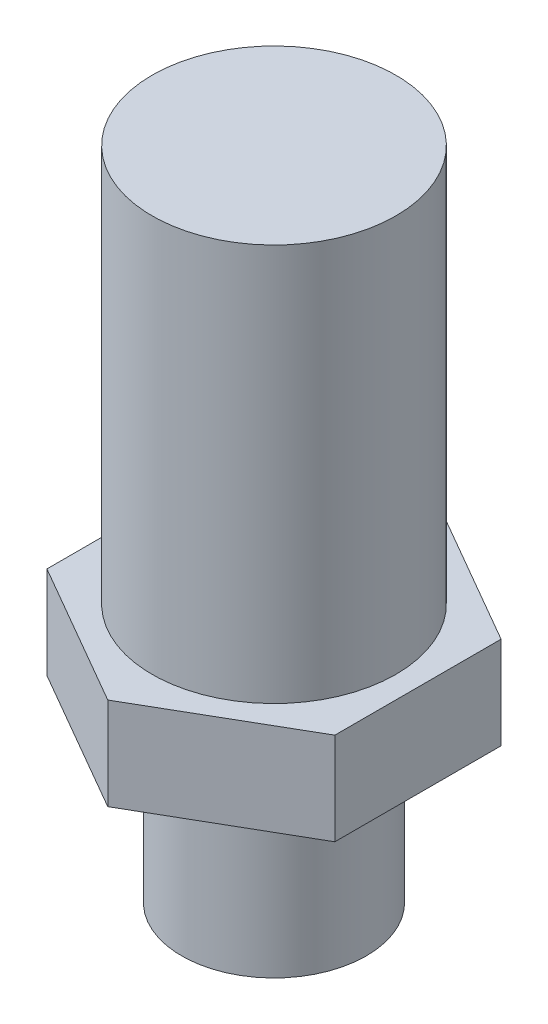
ISO-10303-21;
HEADER;
FILE_DESCRIPTION(('STEP AP214'),'2;1');
FILE_NAME('part.step','',(''),(''),'','','');
FILE_SCHEMA(('AUTOMOTIVE_DESIGN { 1 0 10303 214 1 1 1 1 }'));
ENDSEC;
DATA;
#1=APPLICATION_CONTEXT('core data for automotive mechanical design processes');
#2=APPLICATION_PROTOCOL_DEFINITION('international standard','automotive_design',2000,#1);
#3=PRODUCT_CONTEXT('',#1,'mechanical');
#4=PRODUCT('Part','Part','',(#3));
#5=PRODUCT_RELATED_PRODUCT_CATEGORY('part','',(#4));
#6=PRODUCT_DEFINITION_FORMATION('','',#4);
#7=PRODUCT_DEFINITION_CONTEXT('part definition',#1,'design');
#8=PRODUCT_DEFINITION('design','',#6,#7);
#9=PRODUCT_DEFINITION_SHAPE('','',#8);
#10=(LENGTH_UNIT() NAMED_UNIT(*) SI_UNIT(.MILLI.,.METRE.));
#11=(NAMED_UNIT(*) PLANE_ANGLE_UNIT() SI_UNIT($,.RADIAN.));
#12=(NAMED_UNIT(*) SI_UNIT($,.STERADIAN.) SOLID_ANGLE_UNIT());
#13=UNCERTAINTY_MEASURE_WITH_UNIT(LENGTH_MEASURE(1.E-05),#10,'distance_accuracy_value','');
#14=(GEOMETRIC_REPRESENTATION_CONTEXT(3) GLOBAL_UNCERTAINTY_ASSIGNED_CONTEXT((#13)) GLOBAL_UNIT_ASSIGNED_CONTEXT((#10,
#11,#12)) REPRESENTATION_CONTEXT('',''));
#15=CARTESIAN_POINT('',(0.,0.,0.));
#16=DIRECTION('',(0.,0.,1.));
#17=DIRECTION('',(1.,0.,0.));
#18=AXIS2_PLACEMENT_3D('',#15,#16,#17);
#19=CARTESIAN_POINT('',(0.,-15.3778409015756,0.));
#20=DIRECTION('',(0.,1.,0.));
#21=DIRECTION('',(-1.,0.,0.));
#22=AXIS2_PLACEMENT_3D('',#19,#20,#21);
#23=PLANE('',#22);
#24=CARTESIAN_POINT('',(-9.29248509114594,-15.3778409015756,0.));
#25=DIRECTION('',(0.,1.,0.));
#26=DIRECTION('',(-1.,0.,0.));
#27=AXIS2_PLACEMENT_3D('',#24,#25,#26);
#28=CIRCLE('',#27,1.6764);
#29=CARTESIAN_POINT('',(-10.9688850911459,-15.3778409015756,0.));
#30=VERTEX_POINT('',#29);
#31=EDGE_CURVE('E137',#30,#30,#28,.T.);
#32=ORIENTED_EDGE('',*,*,#31,.T.);
#33=EDGE_LOOP('',(#32));
#34=FACE_BOUND('',#33,.T.);
#35=ADVANCED_FACE('F37',(#34),#23,.T.);
#36=CARTESIAN_POINT('',(-9.29248509114593,-45.5840335622125,0.));
#37=DIRECTION('',(0.,1.,0.));
#38=DIRECTION('',(-1.,0.,0.));
#39=AXIS2_PLACEMENT_3D('',#36,#37,#38);
#40=CYLINDRICAL_SURFACE('',#39,1.6764);
#41=CARTESIAN_POINT('',(-9.29248509114594,-20.8388409015756,0.));
#42=DIRECTION('',(0.,1.,0.));
#43=DIRECTION('',(-1.,0.,0.));
#44=AXIS2_PLACEMENT_3D('',#41,#42,#43);
#45=CIRCLE('',#44,1.6764);
#46=CARTESIAN_POINT('',(-10.9688850911459,-20.8388409015756,0.));
#47=VERTEX_POINT('',#46);
#48=EDGE_CURVE('E134',#47,#47,#45,.T.);
#49=ORIENTED_EDGE('',*,*,#48,.T.);
#50=EDGE_LOOP('',(#49));
#51=FACE_BOUND('',#50,.T.);
#52=ORIENTED_EDGE('',*,*,#31,.F.);
#53=EDGE_LOOP('',(#52));
#54=FACE_BOUND('',#53,.T.);
#55=ADVANCED_FACE('F170',(#51,#54),#40,.T.);
#56=CARTESIAN_POINT('',(0.,-20.8388409015756,0.));
#57=DIRECTION('',(0.,1.,0.));
#58=DIRECTION('',(-1.,0.,0.));
#59=AXIS2_PLACEMENT_3D('',#56,#57,#58);
#60=PLANE('',#59);
#61=DIRECTION('',(0.,0.,-1.));
#62=VECTOR('',#61,1.);
#63=CARTESIAN_POINT('',(-11.2722191641972,-20.8388409015756,0.));
#64=LINE('',#63,#62);
#65=CARTESIAN_POINT('',(-11.2722191641972,-20.8388409015756,1.14300000000001));
#66=VERTEX_POINT('',#65);
#67=CARTESIAN_POINT('',(-11.2722191641972,-20.8388409015756,-1.14299999999999));
#68=VERTEX_POINT('',#67);
#69=EDGE_CURVE('E51',#66,#68,#64,.T.);
#70=ORIENTED_EDGE('',*,*,#69,.F.);
#71=DIRECTION('',(-0.866025403784439,0.,-0.499999999999999));
#72=VECTOR('',#71,1.);
#73=CARTESIAN_POINT('',(-3.31298830931209,-20.8388409015756,5.73826407661027));
#74=LINE('',#73,#72);
#75=CARTESIAN_POINT('',(-9.29248509114593,-20.8388409015756,2.28600000000001));
#76=VERTEX_POINT('',#75);
#77=EDGE_CURVE('E117',#76,#66,#74,.T.);
#78=ORIENTED_EDGE('',*,*,#77,.F.);
#79=DIRECTION('',(-0.866025403784438,0.,0.500000000000002));
#80=VECTOR('',#79,1.);
#81=CARTESIAN_POINT('',(-1.33325423626088,-20.8388409015756,-2.30926407661027));
#82=LINE('',#81,#80);
#83=CARTESIAN_POINT('',(-7.3127510180947,-20.8388409015756,1.143));
#84=VERTEX_POINT('',#83);
#85=EDGE_CURVE('E111',#84,#76,#82,.T.);
#86=ORIENTED_EDGE('',*,*,#85,.F.);
#87=DIRECTION('',(0.,0.,1.));
#88=VECTOR('',#87,1.);
#89=CARTESIAN_POINT('',(-7.3127510180947,-20.8388409015756,0.));
#90=LINE('',#89,#88);
#91=CARTESIAN_POINT('',(-7.3127510180947,-20.8388409015756,-1.143));
#92=VERTEX_POINT('',#91);
#93=EDGE_CURVE('E109',#92,#84,#90,.T.);
#94=ORIENTED_EDGE('',*,*,#93,.F.);
#95=DIRECTION('',(0.866025403784439,0.,0.499999999999999));
#96=VECTOR('',#95,1.);
#97=CARTESIAN_POINT('',(-1.33325423626086,-20.8388409015756,2.30926407661026));
#98=LINE('',#97,#96);
#99=CARTESIAN_POINT('',(-9.29248509114594,-20.8388409015756,-2.286));
#100=VERTEX_POINT('',#99);
#101=EDGE_CURVE('E92',#100,#92,#98,.T.);
#102=ORIENTED_EDGE('',*,*,#101,.F.);
#103=DIRECTION('',(0.866025403784437,0.,-0.500000000000002));
#104=VECTOR('',#103,1.);
#105=CARTESIAN_POINT('',(-3.31298830931212,-20.8388409015756,-5.73826407661028));
#106=LINE('',#105,#104);
#107=EDGE_CURVE('E101',#68,#100,#106,.T.);
#108=ORIENTED_EDGE('',*,*,#107,.F.);
#109=EDGE_LOOP('',(#70,#78,#86,#94,#102,#108));
#110=FACE_BOUND('',#109,.T.);
#111=ORIENTED_EDGE('',*,*,#48,.F.);
#112=EDGE_LOOP('',(#111));
#113=FACE_BOUND('',#112,.T.);
#114=ADVANCED_FACE('F105',(#110,#113),#60,.T.);
#115=CARTESIAN_POINT('',(-11.2722191641972,-23.3788409015756,0.));
#116=DIRECTION('',(1.,0.,0.));
#117=DIRECTION('',(0.,0.,-1.));
#118=AXIS2_PLACEMENT_3D('',#115,#116,#117);
#119=PLANE('',#118);
#120=DIRECTION('',(0.,1.,0.));
#121=VECTOR('',#120,1.);
#122=CARTESIAN_POINT('',(-11.2722191641972,-23.3788409015756,1.14300000000001));
#123=LINE('',#122,#121);
#124=CARTESIAN_POINT('',(-11.2722191641972,-22.1088409015756,1.14300000000001));
#125=VERTEX_POINT('',#124);
#126=EDGE_CURVE('E120',#125,#66,#123,.T.);
#127=ORIENTED_EDGE('',*,*,#126,.T.);
#128=ORIENTED_EDGE('',*,*,#69,.T.);
#129=DIRECTION('',(0.,1.,0.));
#130=VECTOR('',#129,1.);
#131=CARTESIAN_POINT('',(-11.2722191641972,-23.3788409015756,-1.14299999999999));
#132=LINE('',#131,#130);
#133=CARTESIAN_POINT('',(-11.2722191641972,-22.1088409015756,-1.14299999999999));
#134=VERTEX_POINT('',#133);
#135=EDGE_CURVE('E98',#134,#68,#132,.T.);
#136=ORIENTED_EDGE('',*,*,#135,.F.);
#137=DIRECTION('',(0.,0.,-1.));
#138=VECTOR('',#137,1.);
#139=CARTESIAN_POINT('',(-11.2722191641972,-22.1088409015756,0.));
#140=LINE('',#139,#138);
#141=EDGE_CURVE('E11',#125,#134,#140,.T.);
#142=ORIENTED_EDGE('',*,*,#141,.F.);
#143=EDGE_LOOP('',(#127,#128,#136,#142));
#144=FACE_BOUND('',#143,.T.);
#145=ADVANCED_FACE('F162',(#144),#119,.F.);
#146=CARTESIAN_POINT('',(-3.31298830931209,-23.3788409015756,5.73826407661027));
#147=DIRECTION('',(0.499999999999999,0.,-0.866025403784439));
#148=DIRECTION('',(-0.866025403784439,0.,-0.499999999999999));
#149=AXIS2_PLACEMENT_3D('',#146,#147,#148);
#150=PLANE('',#149);
#151=DIRECTION('',(0.,1.,0.));
#152=VECTOR('',#151,1.);
#153=CARTESIAN_POINT('',(-9.29248509114593,-23.3788409015756,2.28600000000001));
#154=LINE('',#153,#152);
#155=CARTESIAN_POINT('',(-9.29248509114593,-22.1088409015756,2.28600000000001));
#156=VERTEX_POINT('',#155);
#157=EDGE_CURVE('E123',#156,#76,#154,.T.);
#158=ORIENTED_EDGE('',*,*,#157,.T.);
#159=ORIENTED_EDGE('',*,*,#77,.T.);
#160=ORIENTED_EDGE('',*,*,#126,.F.);
#161=DIRECTION('',(-0.866025403784439,0.,-0.499999999999999));
#162=VECTOR('',#161,1.);
#163=CARTESIAN_POINT('',(-3.31298830931209,-22.1088409015756,5.73826407661027));
#164=LINE('',#163,#162);
#165=EDGE_CURVE('E44',#156,#125,#164,.T.);
#166=ORIENTED_EDGE('',*,*,#165,.F.);
#167=EDGE_LOOP('',(#158,#159,#160,#166));
#168=FACE_BOUND('',#167,.T.);
#169=ADVANCED_FACE('F155',(#168),#150,.F.);
#170=CARTESIAN_POINT('',(-1.33325423626088,-23.3788409015756,-2.30926407661027));
#171=DIRECTION('',(-0.500000000000002,0.,-0.866025403784438));
#172=DIRECTION('',(-0.866025403784438,0.,0.500000000000002));
#173=AXIS2_PLACEMENT_3D('',#170,#171,#172);
#174=PLANE('',#173);
#175=DIRECTION('',(0.,1.,0.));
#176=VECTOR('',#175,1.);
#177=CARTESIAN_POINT('',(-7.3127510180947,-23.3788409015756,1.143));
#178=LINE('',#177,#176);
#179=CARTESIAN_POINT('',(-7.3127510180947,-22.1088409015756,1.143));
#180=VERTEX_POINT('',#179);
#181=EDGE_CURVE('E125',#180,#84,#178,.T.);
#182=ORIENTED_EDGE('',*,*,#181,.T.);
#183=ORIENTED_EDGE('',*,*,#85,.T.);
#184=ORIENTED_EDGE('',*,*,#157,.F.);
#185=DIRECTION('',(-0.866025403784438,0.,0.500000000000002));
#186=VECTOR('',#185,1.);
#187=CARTESIAN_POINT('',(-1.33325423626088,-22.1088409015756,-2.30926407661027));
#188=LINE('',#187,#186);
#189=EDGE_CURVE('E146',#180,#156,#188,.T.);
#190=ORIENTED_EDGE('',*,*,#189,.F.);
#191=EDGE_LOOP('',(#182,#183,#184,#190));
#192=FACE_BOUND('',#191,.T.);
#193=ADVANCED_FACE('F157',(#192),#174,.F.);
#194=CARTESIAN_POINT('',(-7.3127510180947,-23.3788409015756,0.));
#195=DIRECTION('',(-1.,0.,0.));
#196=DIRECTION('',(0.,0.,1.));
#197=AXIS2_PLACEMENT_3D('',#194,#195,#196);
#198=PLANE('',#197);
#199=DIRECTION('',(0.,1.,0.));
#200=VECTOR('',#199,1.);
#201=CARTESIAN_POINT('',(-7.3127510180947,-23.3788409015756,-1.143));
#202=LINE('',#201,#200);
#203=CARTESIAN_POINT('',(-7.3127510180947,-22.1088409015756,-1.143));
#204=VERTEX_POINT('',#203);
#205=EDGE_CURVE('E97',#204,#92,#202,.T.);
#206=ORIENTED_EDGE('',*,*,#205,.T.);
#207=ORIENTED_EDGE('',*,*,#93,.T.);
#208=ORIENTED_EDGE('',*,*,#181,.F.);
#209=DIRECTION('',(0.,0.,1.));
#210=VECTOR('',#209,1.);
#211=CARTESIAN_POINT('',(-7.3127510180947,-22.1088409015756,0.));
#212=LINE('',#211,#210);
#213=EDGE_CURVE('E143',#204,#180,#212,.T.);
#214=ORIENTED_EDGE('',*,*,#213,.F.);
#215=EDGE_LOOP('',(#206,#207,#208,#214));
#216=FACE_BOUND('',#215,.T.);
#217=ADVANCED_FACE('F161',(#216),#198,.F.);
#218=CARTESIAN_POINT('',(-1.33325423626086,-23.3788409015756,2.30926407661026));
#219=DIRECTION('',(-0.499999999999998,0.,0.866025403784439));
#220=DIRECTION('',(0.86602540378444,0.,0.499999999999999));
#221=AXIS2_PLACEMENT_3D('',#218,#219,#220);
#222=PLANE('',#221);
#223=DIRECTION('',(0.,1.,0.));
#224=VECTOR('',#223,1.);
#225=CARTESIAN_POINT('',(-9.29248509114594,-23.3788409015756,-2.286));
#226=LINE('',#225,#224);
#227=CARTESIAN_POINT('',(-9.29248509114594,-22.1088409015756,-2.286));
#228=VERTEX_POINT('',#227);
#229=EDGE_CURVE('E59',#228,#100,#226,.T.);
#230=ORIENTED_EDGE('',*,*,#229,.T.);
#231=ORIENTED_EDGE('',*,*,#101,.T.);
#232=ORIENTED_EDGE('',*,*,#205,.F.);
#233=DIRECTION('',(0.86602540378444,0.,0.499999999999999));
#234=VECTOR('',#233,1.);
#235=CARTESIAN_POINT('',(-1.33325423626086,-22.1088409015756,2.30926407661026));
#236=LINE('',#235,#234);
#237=EDGE_CURVE('E95',#228,#204,#236,.T.);
#238=ORIENTED_EDGE('',*,*,#237,.F.);
#239=EDGE_LOOP('',(#230,#231,#232,#238));
#240=FACE_BOUND('',#239,.T.);
#241=ADVANCED_FACE('F89',(#240),#222,.F.);
#242=CARTESIAN_POINT('',(-3.31298830931212,-23.3788409015756,-5.73826407661028));
#243=DIRECTION('',(0.500000000000002,0.,0.866025403784437));
#244=DIRECTION('',(0.866025403784437,0.,-0.500000000000002));
#245=AXIS2_PLACEMENT_3D('',#242,#243,#244);
#246=PLANE('',#245);
#247=ORIENTED_EDGE('',*,*,#135,.T.);
#248=ORIENTED_EDGE('',*,*,#107,.T.);
#249=ORIENTED_EDGE('',*,*,#229,.F.);
#250=DIRECTION('',(0.866025403784437,0.,-0.500000000000002));
#251=VECTOR('',#250,1.);
#252=CARTESIAN_POINT('',(-3.31298830931212,-22.1088409015756,-5.73826407661028));
#253=LINE('',#252,#251);
#254=EDGE_CURVE('E140',#134,#228,#253,.T.);
#255=ORIENTED_EDGE('',*,*,#254,.F.);
#256=EDGE_LOOP('',(#247,#248,#249,#255));
#257=FACE_BOUND('',#256,.T.);
#258=ADVANCED_FACE('F102',(#257),#246,.F.);
#259=CARTESIAN_POINT('',(0.,-24.3948409015756,0.));
#260=DIRECTION('',(0.,-1.,0.));
#261=DIRECTION('',(1.,0.,0.));
#262=AXIS2_PLACEMENT_3D('',#259,#260,#261);
#263=PLANE('',#262);
#264=CARTESIAN_POINT('',(-9.29248509114594,-24.3948409015756,0.));
#265=DIRECTION('',(0.,1.,0.));
#266=DIRECTION('',(-1.,0.,0.));
#267=AXIS2_PLACEMENT_3D('',#264,#265,#266);
#268=CIRCLE('',#267,1.27);
#269=CARTESIAN_POINT('',(-10.5624850911459,-24.3948409015756,0.));
#270=VERTEX_POINT('',#269);
#271=EDGE_CURVE('E122',#270,#270,#268,.T.);
#272=ORIENTED_EDGE('',*,*,#271,.F.);
#273=EDGE_LOOP('',(#272));
#274=FACE_BOUND('',#273,.T.);
#275=ADVANCED_FACE('F189',(#274),#263,.T.);
#276=CARTESIAN_POINT('',(-9.29248509114593,-45.5840335622125,0.));
#277=DIRECTION('',(0.,1.,0.));
#278=DIRECTION('',(-1.,0.,0.));
#279=AXIS2_PLACEMENT_3D('',#276,#277,#278);
#280=CYLINDRICAL_SURFACE('',#279,1.27);
#281=ORIENTED_EDGE('',*,*,#271,.T.);
#282=EDGE_LOOP('',(#281));
#283=FACE_BOUND('',#282,.T.);
#284=CARTESIAN_POINT('',(-9.29248509114594,-22.1088409015756,0.));
#285=DIRECTION('',(0.,1.,0.));
#286=DIRECTION('',(-1.,0.,0.));
#287=AXIS2_PLACEMENT_3D('',#284,#285,#286);
#288=CIRCLE('',#287,1.27);
#289=CARTESIAN_POINT('',(-10.5624850911459,-22.1088409015756,0.));
#290=VERTEX_POINT('',#289);
#291=EDGE_CURVE('E131',#290,#290,#288,.T.);
#292=ORIENTED_EDGE('',*,*,#291,.F.);
#293=EDGE_LOOP('',(#292));
#294=FACE_BOUND('',#293,.T.);
#295=ADVANCED_FACE('F187',(#283,#294),#280,.T.);
#296=CARTESIAN_POINT('',(0.,-22.1088409015756,0.));
#297=DIRECTION('',(0.,1.,0.));
#298=DIRECTION('',(-1.,0.,0.));
#299=AXIS2_PLACEMENT_3D('',#296,#297,#298);
#300=PLANE('',#299);
#301=ORIENTED_EDGE('',*,*,#165,.T.);
#302=ORIENTED_EDGE('',*,*,#141,.T.);
#303=ORIENTED_EDGE('',*,*,#254,.T.);
#304=ORIENTED_EDGE('',*,*,#237,.T.);
#305=ORIENTED_EDGE('',*,*,#213,.T.);
#306=ORIENTED_EDGE('',*,*,#189,.T.);
#307=EDGE_LOOP('',(#301,#302,#303,#304,#305,#306));
#308=FACE_BOUND('',#307,.T.);
#309=ORIENTED_EDGE('',*,*,#291,.T.);
#310=EDGE_LOOP('',(#309));
#311=FACE_BOUND('',#310,.T.);
#312=ADVANCED_FACE('F150',(#308,#311),#300,.F.);
#313=CLOSED_SHELL('',(#35,#55,#114,#145,#169,#193,#217,#241,#258,#275,#295,#312));
#314=MANIFOLD_SOLID_BREP('B2',#313);
#315=ADVANCED_BREP_SHAPE_REPRESENTATION('',(#18,#314),#14);
#316=SHAPE_DEFINITION_REPRESENTATION(#9,#315);
ENDSEC;
END-ISO-10303-21;
